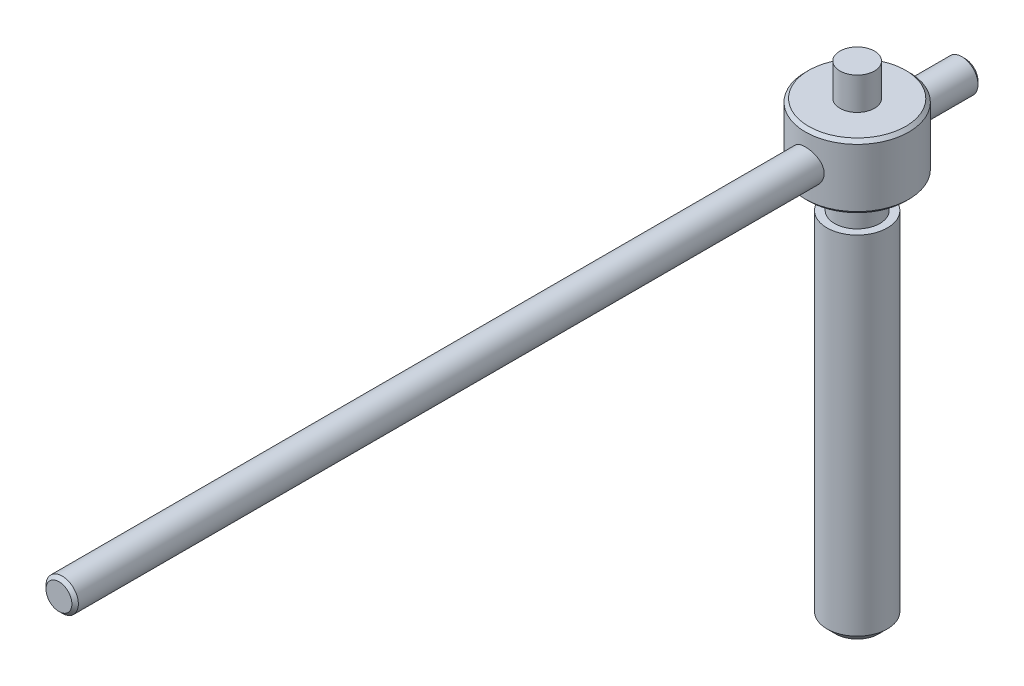
ISO-10303-21;
HEADER;
FILE_DESCRIPTION(('STEP AP214'),'2;1');
FILE_NAME('part.step','',(''),(''),'','','');
FILE_SCHEMA(('AUTOMOTIVE_DESIGN { 1 0 10303 214 1 1 1 1 }'));
ENDSEC;
DATA;
#1=APPLICATION_CONTEXT('core data for automotive mechanical design processes');
#2=APPLICATION_PROTOCOL_DEFINITION('international standard','automotive_design',2000,#1);
#3=PRODUCT_CONTEXT('',#1,'mechanical');
#4=PRODUCT('Part','Part','',(#3));
#5=PRODUCT_RELATED_PRODUCT_CATEGORY('part','',(#4));
#6=PRODUCT_DEFINITION_FORMATION('','',#4);
#7=PRODUCT_DEFINITION_CONTEXT('part definition',#1,'design');
#8=PRODUCT_DEFINITION('design','',#6,#7);
#9=PRODUCT_DEFINITION_SHAPE('','',#8);
#10=(LENGTH_UNIT() NAMED_UNIT(*) SI_UNIT(.MILLI.,.METRE.));
#11=(NAMED_UNIT(*) PLANE_ANGLE_UNIT() SI_UNIT($,.RADIAN.));
#12=(NAMED_UNIT(*) SI_UNIT($,.STERADIAN.) SOLID_ANGLE_UNIT());
#13=UNCERTAINTY_MEASURE_WITH_UNIT(LENGTH_MEASURE(1.E-05),#10,'distance_accuracy_value','');
#14=(GEOMETRIC_REPRESENTATION_CONTEXT(3) GLOBAL_UNCERTAINTY_ASSIGNED_CONTEXT((#13)) GLOBAL_UNIT_ASSIGNED_CONTEXT((#10,
#11,#12)) REPRESENTATION_CONTEXT('',''));
#15=CARTESIAN_POINT('',(0.,0.,0.));
#16=DIRECTION('',(0.,0.,1.));
#17=DIRECTION('',(1.,0.,0.));
#18=AXIS2_PLACEMENT_3D('',#15,#16,#17);
#19=CARTESIAN_POINT('',(0.,165.,0.));
#20=DIRECTION('',(0.,-1.,0.));
#21=DIRECTION('',(0.,0.,-1.));
#22=AXIS2_PLACEMENT_3D('',#19,#20,#21);
#23=CYLINDRICAL_SURFACE('',#22,14.);
#24=CARTESIAN_POINT('',(0.,3.99999999999998,0.));
#25=DIRECTION('',(0.,1.,0.));
#26=DIRECTION('',(0.,0.,1.));
#27=AXIS2_PLACEMENT_3D('',#24,#25,#26);
#28=CIRCLE('',#27,14.);
#29=CARTESIAN_POINT('',(0.,3.99999999999998,14.));
#30=VERTEX_POINT('',#29);
#31=EDGE_CURVE('E329',#30,#30,#28,.T.);
#32=ORIENTED_EDGE('',*,*,#31,.T.);
#33=EDGE_LOOP('',(#32));
#34=FACE_BOUND('',#33,.T.);
#35=CARTESIAN_POINT('',(0.,165.,0.));
#36=DIRECTION('',(0.,1.,0.));
#37=DIRECTION('',(0.,0.,1.));
#38=AXIS2_PLACEMENT_3D('',#35,#36,#37);
#39=CIRCLE('',#38,14.);
#40=CARTESIAN_POINT('',(0.,165.,14.));
#41=VERTEX_POINT('',#40);
#42=EDGE_CURVE('E335',#41,#41,#39,.T.);
#43=ORIENTED_EDGE('',*,*,#42,.F.);
#44=EDGE_LOOP('',(#43));
#45=FACE_BOUND('',#44,.T.);
#46=ADVANCED_FACE('F41',(#34,#45),#23,.T.);
#47=CARTESIAN_POINT('',(0.,165.,0.));
#48=DIRECTION('',(0.,1.,0.));
#49=DIRECTION('',(0.,0.,1.));
#50=AXIS2_PLACEMENT_3D('',#47,#48,#49);
#51=PLANE('',#50);
#52=CARTESIAN_POINT('',(0.,165.,0.));
#53=DIRECTION('',(0.,1.,0.));
#54=DIRECTION('',(0.,0.,1.));
#55=AXIS2_PLACEMENT_3D('',#52,#53,#54);
#56=CIRCLE('',#55,10.5);
#57=CARTESIAN_POINT('',(0.,165.,10.5));
#58=VERTEX_POINT('',#57);
#59=EDGE_CURVE('E332',#58,#58,#56,.T.);
#60=ORIENTED_EDGE('',*,*,#59,.F.);
#61=EDGE_LOOP('',(#60));
#62=FACE_BOUND('',#61,.T.);
#63=ORIENTED_EDGE('',*,*,#42,.T.);
#64=EDGE_LOOP('',(#63));
#65=FACE_BOUND('',#64,.T.);
#66=ADVANCED_FACE('F122',(#62,#65),#51,.T.);
#67=CARTESIAN_POINT('',(0.,0.,0.));
#68=DIRECTION('',(0.,1.,0.));
#69=DIRECTION('',(0.,0.,1.));
#70=AXIS2_PLACEMENT_3D('',#67,#68,#69);
#71=PLANE('',#70);
#72=CARTESIAN_POINT('',(0.,0.,0.));
#73=DIRECTION('',(0.,1.,0.));
#74=DIRECTION('',(0.,0.,1.));
#75=AXIS2_PLACEMENT_3D('',#72,#73,#74);
#76=CIRCLE('',#75,9.99999999999999);
#77=CARTESIAN_POINT('',(0.,0.,9.99999999999999));
#78=VERTEX_POINT('',#77);
#79=EDGE_CURVE('E328',#78,#78,#76,.F.);
#80=ORIENTED_EDGE('',*,*,#79,.T.);
#81=EDGE_LOOP('',(#80));
#82=FACE_BOUND('',#81,.T.);
#83=ADVANCED_FACE('F128',(#82),#71,.F.);
#84=CARTESIAN_POINT('',(0.,180.,0.));
#85=DIRECTION('',(0.,-1.,0.));
#86=DIRECTION('',(0.,0.,-1.));
#87=AXIS2_PLACEMENT_3D('',#84,#85,#86);
#88=CYLINDRICAL_SURFACE('',#87,10.5);
#89=CARTESIAN_POINT('',(0.,180.,0.));
#90=DIRECTION('',(0.,1.,0.));
#91=DIRECTION('',(0.,0.,1.));
#92=AXIS2_PLACEMENT_3D('',#89,#90,#91);
#93=CIRCLE('',#92,10.5);
#94=CARTESIAN_POINT('',(0.,180.,10.5));
#95=VERTEX_POINT('',#94);
#96=EDGE_CURVE('E338',#95,#95,#93,.T.);
#97=ORIENTED_EDGE('',*,*,#96,.F.);
#98=EDGE_LOOP('',(#97));
#99=FACE_BOUND('',#98,.T.);
#100=ORIENTED_EDGE('',*,*,#59,.T.);
#101=EDGE_LOOP('',(#100));
#102=FACE_BOUND('',#101,.T.);
#103=ADVANCED_FACE('F142',(#99,#102),#88,.T.);
#104=CARTESIAN_POINT('',(0.,3.99999999999998,0.));
#105=DIRECTION('',(0.,1.,0.));
#106=DIRECTION('',(0.,0.,1.));
#107=AXIS2_PLACEMENT_3D('',#104,#105,#106);
#108=CONICAL_SURFACE('',#107,14.,0.785398163397452);
#109=ORIENTED_EDGE('',*,*,#79,.F.);
#110=EDGE_LOOP('',(#109));
#111=FACE_BOUND('',#110,.T.);
#112=ORIENTED_EDGE('',*,*,#31,.F.);
#113=EDGE_LOOP('',(#112));
#114=FACE_BOUND('',#113,.T.);
#115=ADVANCED_FACE('F136',(#111,#114),#108,.T.);
#116=CARTESIAN_POINT('',(0.,210.,0.));
#117=DIRECTION('',(0.,-1.,0.));
#118=DIRECTION('',(0.,0.,-1.));
#119=AXIS2_PLACEMENT_3D('',#116,#117,#118);
#120=CYLINDRICAL_SURFACE('',#119,24.);
#121=CARTESIAN_POINT('',(0.,181.5,0.));
#122=DIRECTION('',(0.,1.,0.));
#123=DIRECTION('',(0.,0.,1.));
#124=AXIS2_PLACEMENT_3D('',#121,#122,#123);
#125=CIRCLE('',#124,24.);
#126=CARTESIAN_POINT('',(0.,181.5,24.));
#127=VERTEX_POINT('',#126);
#128=EDGE_CURVE('E68',#127,#127,#125,.T.);
#129=ORIENTED_EDGE('',*,*,#128,.T.);
#130=EDGE_LOOP('',(#129));
#131=FACE_BOUND('',#130,.T.);
#132=CARTESIAN_POINT('',(0.,208.5,0.));
#133=DIRECTION('',(0.,1.,0.));
#134=DIRECTION('',(0.,0.,1.));
#135=AXIS2_PLACEMENT_3D('',#132,#133,#134);
#136=CIRCLE('',#135,24.);
#137=CARTESIAN_POINT('',(0.,208.5,24.));
#138=VERTEX_POINT('',#137);
#139=EDGE_CURVE('E71',#138,#138,#136,.F.);
#140=ORIENTED_EDGE('',*,*,#139,.T.);
#141=EDGE_LOOP('',(#140));
#142=FACE_BOUND('',#141,.T.);
#143=CARTESIAN_POINT('',(0.,202.5,-24.));
#144=CARTESIAN_POINT('',(-0.205322725134183,202.499999751171,-23.9999998377504));
#145=CARTESIAN_POINT('',(-0.410649569542959,202.491561595386,-23.9973589602172));
#146=CARTESIAN_POINT('',(-0.819788345223739,202.457887308774,-23.9868678496232));
#147=CARTESIAN_POINT('',(-1.02360023659106,202.432650737043,-23.9790174798298));
#148=CARTESIAN_POINT('',(-1.42822261784368,202.365611481602,-23.9583225038608));
#149=CARTESIAN_POINT('',(-1.62903309471248,202.32380872607,-23.9454778760327));
#150=CARTESIAN_POINT('',(-2.02629699725516,202.223993923456,-23.915138103417));
#151=CARTESIAN_POINT('',(-2.22274878087906,202.165975875863,-23.8976412371731));
#152=CARTESIAN_POINT('',(-2.60950749706709,202.034351566784,-23.8585028646378));
#153=CARTESIAN_POINT('',(-2.79982570417056,201.960776037888,-23.8368695375509));
#154=CARTESIAN_POINT('',(-3.17350213971867,201.798560955903,-23.7900068509816));
#155=CARTESIAN_POINT('',(-3.35685771837273,201.709915736609,-23.7647761394598));
#156=CARTESIAN_POINT('',(-3.89458593950664,201.422394777373,-23.684659386319));
#157=CARTESIAN_POINT('',(-4.23696718249441,201.201814869027,-23.6253118391135));
#158=CARTESIAN_POINT('',(-4.88988906798732,200.70199224391,-23.49899818284));
#159=CARTESIAN_POINT('',(-5.19927835160978,200.421287729742,-23.431866009511));
#160=CARTESIAN_POINT('',(-5.62522317764967,199.964910807028,-23.3319148528872));
#161=CARTESIAN_POINT('',(-5.76091944636601,199.806791127462,-23.298702268967));
#162=CARTESIAN_POINT('',(-6.01877901219907,199.479688521212,-23.2334232385609));
#163=CARTESIAN_POINT('',(-6.14094731184569,199.310709646946,-23.2013563713898));
#164=CARTESIAN_POINT('',(-6.37383290789079,198.958528788869,-23.138478391768));
#165=CARTESIAN_POINT('',(-6.48418455843552,198.775075853637,-23.1077192063458));
#166=CARTESIAN_POINT('',(-6.688944845992,198.399090418885,-23.0492809312027));
#167=CARTESIAN_POINT('',(-6.78335934843381,198.206561293241,-23.0216007095998));
#168=CARTESIAN_POINT('',(-6.95551662350109,197.813678488346,-22.9701734139065));
#169=CARTESIAN_POINT('',(-7.03325957764037,197.613324894313,-22.9464262969945));
#170=CARTESIAN_POINT('',(-7.17138329046661,197.20623120454,-22.9036350005793));
#171=CARTESIAN_POINT('',(-7.23176472600763,196.999491358121,-22.8845906377393));
#172=CARTESIAN_POINT('',(-7.33304485595034,196.587480033156,-22.8523345362484));
#173=CARTESIAN_POINT('',(-7.37447517055589,196.382351592993,-22.8389645207808));
#174=CARTESIAN_POINT('',(-7.44007143333098,195.969075403876,-22.8176802195024));
#175=CARTESIAN_POINT('',(-7.46423805677483,195.760927773343,-22.8097657202981));
#176=CARTESIAN_POINT('',(-7.49506665014332,195.343247342939,-22.7996543887654));
#177=CARTESIAN_POINT('',(-7.5017324719861,195.133714858054,-22.7974562982592));
#178=CARTESIAN_POINT('',(-7.49750308016062,194.714849177447,-22.798847640284));
#179=CARTESIAN_POINT('',(-7.4866082861608,194.505515977082,-22.8024369345065));
#180=CARTESIAN_POINT('',(-7.44815028871798,194.09696651092,-22.8150266906269));
#181=CARTESIAN_POINT('',(-7.42126713739477,193.897678956435,-22.8238063001078));
#182=CARTESIAN_POINT('',(-7.35164412083876,193.502110867368,-22.8463271895449));
#183=CARTESIAN_POINT('',(-7.30889898419851,193.305831355053,-22.8600701189185));
#184=CARTESIAN_POINT('',(-7.20793845822806,192.91773770129,-22.8921039351418));
#185=CARTESIAN_POINT('',(-7.14972749669862,192.725922298854,-22.9103935202067));
#186=CARTESIAN_POINT('',(-7.01828248191267,192.347872949696,-22.9510008463907));
#187=CARTESIAN_POINT('',(-6.94504274296934,192.161641146011,-22.9733201116332));
#188=CARTESIAN_POINT('',(-6.78296906367783,191.793385741548,-23.0216980223206));
#189=CARTESIAN_POINT('',(-6.69392810993063,191.611459690793,-23.0478053455082));
#190=CARTESIAN_POINT('',(-6.50160323429421,191.255662029723,-23.1027954365562));
#191=CARTESIAN_POINT('',(-6.39831443500596,191.081793204947,-23.1316791538159));
#192=CARTESIAN_POINT('',(-6.17821458182801,190.743188881368,-23.1914351403816));
#193=CARTESIAN_POINT('',(-6.06140291604376,190.578453796355,-23.2223074996433));
#194=CARTESIAN_POINT('',(-5.81500353033671,190.259070014287,-23.2852292005913));
#195=CARTESIAN_POINT('',(-5.6854154157877,190.104421629026,-23.3172785786129));
#196=CARTESIAN_POINT('',(-5.40803838855426,189.799273726757,-23.3832066732621));
#197=CARTESIAN_POINT('',(-5.25968805523365,189.649287623095,-23.4171020059705));
#198=CARTESIAN_POINT('',(-4.95086825425923,189.362330337025,-23.4843322989423));
#199=CARTESIAN_POINT('',(-4.79040268091213,189.225355004151,-23.5176674350978));
#200=CARTESIAN_POINT('',(-4.45824050436648,188.965216591424,-23.5828909399427));
#201=CARTESIAN_POINT('',(-4.28653884197012,188.842059802249,-23.6147786458101));
#202=CARTESIAN_POINT('',(-3.93312831197264,188.610547166287,-23.6762043413147));
#203=CARTESIAN_POINT('',(-3.75142342237099,188.502185494715,-23.7057432537393));
#204=CARTESIAN_POINT('',(-3.37758895799203,188.300194057681,-23.7619003023785));
#205=CARTESIAN_POINT('',(-3.18538580157275,188.206693084113,-23.7884923568036));
#206=CARTESIAN_POINT('',(-2.7933405676538,188.036314838758,-23.837706641365));
#207=CARTESIAN_POINT('',(-2.59350145142372,187.959431198144,-23.8603303917808));
#208=CARTESIAN_POINT('',(-2.18756250688948,187.822923869234,-23.900965941962));
#209=CARTESIAN_POINT('',(-1.98146298862409,187.763299327737,-23.9189779697021));
#210=CARTESIAN_POINT('',(-1.56454921598557,187.661866284005,-23.9498615550411));
#211=CARTESIAN_POINT('',(-1.353735150212,187.620057070427,-23.9627333178827));
#212=CARTESIAN_POINT('',(-0.937249723618294,187.555926706281,-23.982563170254));
#213=CARTESIAN_POINT('',(-0.731694449214662,187.532914895044,-23.9897305656508));
#214=CARTESIAN_POINT('',(-0.319271296139881,187.503948034065,-23.9987625447026));
#215=CARTESIAN_POINT('',(-0.112403452699271,187.497992528441,-24.0006272700876));
#216=CARTESIAN_POINT('',(0.301067522756543,187.503193989518,-23.9990019562826));
#217=CARTESIAN_POINT('',(0.507670685894437,187.514348714948,-23.9955126184216));
#218=CARTESIAN_POINT('',(0.919093871119439,187.553660697763,-23.9832779342683));
#219=CARTESIAN_POINT('',(1.12391390765372,187.581817817261,-23.9745326306009));
#220=CARTESIAN_POINT('',(1.52516099292489,187.653954170231,-23.9523119121127));
#221=CARTESIAN_POINT('',(1.72166969320957,187.697518769019,-23.9389606608393));
#222=CARTESIAN_POINT('',(2.11028998353638,187.800202615519,-23.9078374038334));
#223=CARTESIAN_POINT('',(2.30240007974011,187.859327064875,-23.8900639198611));
#224=CARTESIAN_POINT('',(2.68084378731564,187.992624286464,-23.8505611345128));
#225=CARTESIAN_POINT('',(2.86717893637272,188.0667930125,-23.8288328969387));
#226=CARTESIAN_POINT('',(3.23302579667981,188.229648974261,-23.781958970286));
#227=CARTESIAN_POINT('',(3.41253490163624,188.318341688236,-23.7568119923151));
#228=CARTESIAN_POINT('',(3.76779434531039,188.511886296499,-23.7030962478877));
#229=CARTESIAN_POINT('',(3.94335090154579,188.617075092219,-23.6744598118865));
#230=CARTESIAN_POINT('',(4.28508888954255,188.841283124861,-23.6149975609094));
#231=CARTESIAN_POINT('',(4.45126705394941,188.960307138209,-23.5841709912553));
#232=CARTESIAN_POINT('',(4.77321005884027,189.211378442719,-23.521126184381));
#233=CARTESIAN_POINT('',(4.92897418901323,189.343426620704,-23.4889078524789));
#234=CARTESIAN_POINT('',(5.22916190190809,189.619713719119,-23.4239077863322));
#235=CARTESIAN_POINT('',(5.37358523830359,189.763952904202,-23.3911260398689));
#236=CARTESIAN_POINT('',(5.65574755611655,190.069735867166,-23.3245442482174));
#237=CARTESIAN_POINT('',(5.7929906014498,190.231740247261,-23.2907557009971));
#238=CARTESIAN_POINT('',(6.05332022130686,190.566905510281,-23.2244560032561));
#239=CARTESIAN_POINT('',(6.17641153784875,190.740062625581,-23.1919444272611));
#240=CARTESIAN_POINT('',(6.40767164258911,191.096552628294,-23.1291182822734));
#241=CARTESIAN_POINT('',(6.51583455782912,191.279889480952,-23.0988045801562));
#242=CARTESIAN_POINT('',(6.71632072791784,191.655404827851,-23.0413088407619));
#243=CARTESIAN_POINT('',(6.80865052748186,191.847579627011,-23.0141255110598));
#244=CARTESIAN_POINT('',(6.97647892399103,192.238859130563,-22.96380621771));
#245=CARTESIAN_POINT('',(7.05203484907426,192.437937456056,-22.9406565285295));
#246=CARTESIAN_POINT('',(7.18603319154452,192.842166519652,-22.8990360803296));
#247=CARTESIAN_POINT('',(7.24448241353361,193.047314807429,-22.8805634612887));
#248=CARTESIAN_POINT('',(7.34375231610201,193.462211374598,-22.848895397));
#249=CARTESIAN_POINT('',(7.384575095796,193.67195910312,-22.8356993233876));
#250=CARTESIAN_POINT('',(7.44819469414369,194.094447299313,-22.8150283856312));
#251=CARTESIAN_POINT('',(7.47099227726117,194.307187639676,-22.8075532788565));
#252=CARTESIAN_POINT('',(7.49771064294923,194.724294859985,-22.7987832741142));
#253=CARTESIAN_POINT('',(7.50243921576498,194.928604849242,-22.7972239310468));
#254=CARTESIAN_POINT('',(7.49521090674663,195.336896191842,-22.7996015156985));
#255=CARTESIAN_POINT('',(7.48325431134384,195.540877550766,-22.8035383490657));
#256=CARTESIAN_POINT('',(7.44277084953878,195.94699774529,-22.8167835798402));
#257=CARTESIAN_POINT('',(7.41424495273264,196.149136688,-22.8260916629346));
#258=CARTESIAN_POINT('',(7.34088853988209,196.550129066818,-22.8497885761783));
#259=CARTESIAN_POINT('',(7.29605795470685,196.748982488991,-22.8641774278698));
#260=CARTESIAN_POINT('',(7.19127743080789,197.139091904865,-22.8973469597821));
#261=CARTESIAN_POINT('',(7.13156223124892,197.330416902638,-22.9160591514322));
#262=CARTESIAN_POINT('',(6.99716063418775,197.707359412064,-22.9574537966096));
#263=CARTESIAN_POINT('',(6.92246923608568,197.892974993385,-22.9801375759408));
#264=CARTESIAN_POINT('',(6.75871120993063,198.257252775182,-23.0288322203934));
#265=CARTESIAN_POINT('',(6.66964720697428,198.43591623805,-23.0548424777677));
#266=CARTESIAN_POINT('',(6.47773101504851,198.785333369464,-23.1094992362476));
#267=CARTESIAN_POINT('',(6.37487388753478,198.956084175328,-23.1381466804248));
#268=CARTESIAN_POINT('',(6.15180562104566,199.295119403823,-23.1984729592827));
#269=CARTESIAN_POINT('',(6.03107452319997,199.463048604738,-23.2302264110723));
#270=CARTESIAN_POINT('',(5.77628434080353,199.788236530681,-23.2948880612276));
#271=CARTESIAN_POINT('',(5.64222486473063,199.945494942025,-23.3277962934968));
#272=CARTESIAN_POINT('',(5.36156593588138,200.248453656183,-23.3938966126454));
#273=CARTESIAN_POINT('',(5.21496129136701,200.394149125201,-23.4270888118785));
#274=CARTESIAN_POINT('',(4.91020758027418,200.672962301218,-23.4928531672747));
#275=CARTESIAN_POINT('',(4.75206237192804,200.806084177971,-23.5254255261125));
#276=CARTESIAN_POINT('',(4.41972055532893,201.063138395092,-23.5901603004584));
#277=CARTESIAN_POINT('',(4.24516594895487,201.186620833839,-23.622273477587));
#278=CARTESIAN_POINT('',(3.88590361550681,201.418366581645,-23.6840232253637));
#279=CARTESIAN_POINT('',(3.7011995883563,201.52663538623,-23.7136606887216));
#280=CARTESIAN_POINT('',(3.32283847153091,201.727152349284,-23.7696299451859));
#281=CARTESIAN_POINT('',(3.12918255783227,201.819402604521,-23.7959621708101));
#282=CARTESIAN_POINT('',(2.73425079317586,201.987123002583,-23.8445683608793));
#283=CARTESIAN_POINT('',(2.53297555799437,202.062594498056,-23.8668426524352));
#284=CARTESIAN_POINT('',(2.14159886031168,202.190429209189,-23.904996906578));
#285=CARTESIAN_POINT('',(1.95199597767635,202.244208721182,-23.9212587889421));
#286=CARTESIAN_POINT('',(1.5687634794647,202.336746420601,-23.9494447033193));
#287=CARTESIAN_POINT('',(1.37513246393651,202.375499290514,-23.9613671996524));
#288=CARTESIAN_POINT('',(0.985222138126735,202.437627528428,-23.9805635724611));
#289=CARTESIAN_POINT('',(0.788943269401387,202.461005428786,-23.9878382144631));
#290=CARTESIAN_POINT('',(0.395110522251881,202.492188765891,-23.9975555697243));
#291=CARTESIAN_POINT('',(0.197557167913419,202.500000239418,-24.0000001561132));
#292=CARTESIAN_POINT('',(0.,202.5,-24.));
#293=B_SPLINE_CURVE_WITH_KNOTS('',3,(#143,#144,#145,#146,#147,#148,#149,#150,#151,#152,#153,
#154,#155,#156,#157,#158,#159,#160,#161,#162,#163,#164,#165,#166,#167,#168,#169,#170,#171,#172,
#173,#174,#175,#176,#177,#178,#179,#180,#181,#182,#183,#184,#185,#186,#187,#188,#189,#190,#191,
#192,#193,#194,#195,#196,#197,#198,#199,#200,#201,#202,#203,#204,#205,#206,#207,#208,#209,#210,
#211,#212,#213,#214,#215,#216,#217,#218,#219,#220,#221,#222,#223,#224,#225,#226,#227,#228,#229,
#230,#231,#232,#233,#234,#235,#236,#237,#238,#239,#240,#241,#242,#243,#244,#245,#246,#247,#248,
#249,#250,#251,#252,#253,#254,#255,#256,#257,#258,#259,#260,#261,#262,#263,#264,#265,#266,#267,
#268,#269,#270,#271,#272,#273,#274,#275,#276,#277,#278,#279,#280,#281,#282,#283,#284,#285,#286,
#287,#288,#289,#290,#291,#292),.UNSPECIFIED.,.T.,.F.,(4,2,2,2,2,2,2,2,2,2,2,2,2,2,2,2,2,2,2,2,2,
2,2,2,2,2,2,2,2,2,2,2,2,2,2,2,2,2,2,2,2,2,2,2,2,2,2,2,2,2,2,2,2,2,2,2,2,2,2,2,2,2,2,2,2,2,2,2,2,
2,2,2,2,2,4),(0.,0.61578575949743,1.23158768205225,1.84739227443666,2.46342504937368,
3.07825208241681,3.69331080388809,4.92233545802383,6.18556526038298,6.81795282859594,
7.45010575866716,8.0981709460351,8.74599710016006,9.39381620062945,10.041610041877,
10.6699095444067,11.298184469472,11.9263210999266,12.5544427192214,13.1575868900243,
13.7609316832687,14.3641039272186,14.9675047853901,15.5794892883362,16.1916838114246,
16.8039060464636,17.4161471971401,18.056395499235,18.6964388698399,19.3367724381893,
19.9768531780835,20.6222098685737,21.2673187767063,21.9123957885282,22.5574470408512,
23.1775709279552,23.797678240198,24.4177043314816,25.037725394533,25.6421925498485,
26.2468620352557,26.8513691084205,27.4561047208284,28.0753625304383,28.6948347691717,
29.3143492172942,29.9338771177891,30.5781005942124,31.2221075685778,31.8663671828882,
32.5103598432337,33.1521164330445,33.7936174007307,34.4350419516482,35.0764392977502,
35.6888021793648,36.3011545487839,36.9134710884071,37.525790224243,38.1290041158202,
38.7324197588389,39.3357253149748,39.9392474606268,40.5662809890488,41.1933329420754,
41.8206456633235,42.4477496142866,43.0956064666582,43.7432286927839,44.39076608361,
45.0382512531918,45.6308652962827,46.2236888581205,46.8164147535804,47.4089107406087),.UNSPECIFIED.);
#294=CARTESIAN_POINT('',(0.,202.5,-24.));
#295=VERTEX_POINT('',#294);
#296=EDGE_CURVE('E75',#295,#295,#293,.T.);
#297=ORIENTED_EDGE('',*,*,#296,.T.);
#298=EDGE_LOOP('',(#297));
#299=FACE_BOUND('',#298,.T.);
#300=CARTESIAN_POINT('',(7.5,195.,22.798026230356));
#301=CARTESIAN_POINT('',(7.49999974700773,194.794953473911,22.7980264222482));
#302=CARTESIAN_POINT('',(7.49158409238975,194.589902804104,22.8008000560015));
#303=CARTESIAN_POINT('',(7.45800176499308,194.181324355647,22.811806564275));
#304=CARTESIAN_POINT('',(7.43283463820416,193.977796618424,22.8200395867594));
#305=CARTESIAN_POINT('',(7.36598489208762,193.573746620706,22.8417052387465));
#306=CARTESIAN_POINT('',(7.32430158745593,193.373224485279,22.8551380840043));
#307=CARTESIAN_POINT('',(7.22478128927094,192.976544363525,22.8867922146891));
#308=CARTESIAN_POINT('',(7.16693826028762,192.780388037376,22.9050152890489));
#309=CARTESIAN_POINT('',(7.03573656859373,192.394259337092,22.945655673757));
#310=CARTESIAN_POINT('',(6.96241208752277,192.204274386225,22.9680637316623));
#311=CARTESIAN_POINT('',(6.80075942305939,191.831238208446,23.0164457249172));
#312=CARTESIAN_POINT('',(6.71242558420898,191.64818962704,23.0424210036694));
#313=CARTESIAN_POINT('',(6.42591332355301,191.11130514933,23.1246020655355));
#314=CARTESIAN_POINT('',(6.20610879065265,190.769393101122,23.1851005811227));
#315=CARTESIAN_POINT('',(5.70710399963079,190.116029536159,23.3130219776492));
#316=CARTESIAN_POINT('',(5.4262668934208,189.80585857615,23.3806018462209));
#317=CARTESIAN_POINT('',(4.96943962580651,189.378763633746,23.4803981200992));
#318=CARTESIAN_POINT('',(4.81113113115132,189.242689759308,23.5134203474061));
#319=CARTESIAN_POINT('',(4.48357099100345,188.984098592999,23.5780705240379));
#320=CARTESIAN_POINT('',(4.31432347663338,188.861576230245,23.6096989922143));
#321=CARTESIAN_POINT('',(3.96189595864876,188.62825927248,23.6714199529493));
#322=CARTESIAN_POINT('',(3.7784846002785,188.517800474826,23.7014601722145));
#323=CARTESIAN_POINT('',(3.40256768378339,188.312822618684,23.7583384799785));
#324=CARTESIAN_POINT('',(3.21006550637826,188.218297693496,23.7851777459686));
#325=CARTESIAN_POINT('',(2.81723436397066,188.04592215844,23.8348984438295));
#326=CARTESIAN_POINT('',(2.61690530154658,187.968071756198,23.8577798264172));
#327=CARTESIAN_POINT('',(2.2098763363084,187.829739010417,23.8989179134953));
#328=CARTESIAN_POINT('',(2.00317667118578,187.769256019754,23.9171747902953));
#329=CARTESIAN_POINT('',(1.59142684741146,187.667816060506,23.9480408393514));
#330=CARTESIAN_POINT('',(1.38652264351255,187.62631410466,23.9608069171928));
#331=CARTESIAN_POINT('',(0.973714193630963,187.560540312013,23.9811296527184));
#332=CARTESIAN_POINT('',(0.765810052365474,187.536267875269,23.9886864917917));
#333=CARTESIAN_POINT('',(0.348613500135681,187.505187404498,23.9983748909556));
#334=CARTESIAN_POINT('',(0.139321357676894,187.498376086085,24.0005074713331));
#335=CARTESIAN_POINT('',(-0.279081496408187,187.502275024589,23.9992890605664));
#336=CARTESIAN_POINT('',(-0.488192211591743,187.512984929825,23.9959381794845));
#337=CARTESIAN_POINT('',(-0.897386858062001,187.551144718768,23.9840599696606));
#338=CARTESIAN_POINT('',(-1.09753193806446,187.577999898937,23.9757165863245));
#339=CARTESIAN_POINT('',(-1.49482266971481,187.647708321365,23.9542291427508));
#340=CARTESIAN_POINT('',(-1.69196729778038,187.690566901155,23.9410834808658));
#341=CARTESIAN_POINT('',(-2.0817747471789,187.791896428239,23.9103414822127));
#342=CARTESIAN_POINT('',(-2.27443899007203,187.850362348003,23.8927465787567));
#343=CARTESIAN_POINT('',(-2.65415400239954,187.982458288355,23.8535514046846));
#344=CARTESIAN_POINT('',(-2.84120262757653,188.056094019061,23.8319496261335));
#345=CARTESIAN_POINT('',(-3.21060832462452,188.218907260486,23.7850178233697));
#346=CARTESIAN_POINT('',(-3.39288346812399,188.308258703421,23.7596466289881));
#347=CARTESIAN_POINT('',(-3.74933035165497,188.501260571493,23.7060123442231));
#348=CARTESIAN_POINT('',(-3.92349928623937,188.604915898516,23.67774826332));
#349=CARTESIAN_POINT('',(-4.26263465978632,188.825787740165,23.619050899331));
#350=CARTESIAN_POINT('',(-4.42760075853918,188.943004755647,23.5886175361459));
#351=CARTESIAN_POINT('',(-4.74736710964657,189.190236435902,23.5263478636096));
#352=CARTESIAN_POINT('',(-4.90216703842023,189.320251507698,23.4945115096563));
#353=CARTESIAN_POINT('',(-5.20696226006289,189.59798075494,23.428889325145));
#354=CARTESIAN_POINT('',(-5.3564847251942,189.746208169505,23.3950776934464));
#355=CARTESIAN_POINT('',(-5.64252659687117,190.054686480488,23.3277406070092));
#356=CARTESIAN_POINT('',(-5.77905013185327,190.21493353039,23.2942150645095));
#357=CARTESIAN_POINT('',(-6.03832079381708,190.54657392947,23.2283573538321));
#358=CARTESIAN_POINT('',(-6.16106111740694,190.717972717794,23.1960257802357));
#359=CARTESIAN_POINT('',(-6.39179285887947,191.070702355177,23.1335096917575));
#360=CARTESIAN_POINT('',(-6.49979002148856,191.252029296885,23.103324342801));
#361=CARTESIAN_POINT('',(-6.70146025809924,191.625681954266,23.0456408967694));
#362=CARTESIAN_POINT('',(-6.79495201481053,191.818111108594,23.0181781595255));
#363=CARTESIAN_POINT('',(-6.96528140892233,192.210626367214,22.9672105647925));
#364=CARTESIAN_POINT('',(-7.0421254589343,192.410709488169,22.9437041841164));
#365=CARTESIAN_POINT('',(-7.17851865799902,192.817154627315,22.9013967635139));
#366=CARTESIAN_POINT('',(-7.238069465127,193.023516041444,22.8825952725067));
#367=CARTESIAN_POINT('',(-7.33931767509125,193.440980576476,22.8503226769008));
#368=CARTESIAN_POINT('',(-7.38101586716288,193.65208348733,22.8368513366666));
#369=CARTESIAN_POINT('',(-7.44483362974042,194.068824332417,22.8161243467247));
#370=CARTESIAN_POINT('',(-7.46767263323138,194.274340979293,22.8086406729225));
#371=CARTESIAN_POINT('',(-7.49630175334413,194.686683295234,22.7992475765619));
#372=CARTESIAN_POINT('',(-7.50209237560239,194.893508925293,22.7973379886823));
#373=CARTESIAN_POINT('',(-7.49656908204168,195.306876901055,22.7991547983648));
#374=CARTESIAN_POINT('',(-7.48525752295286,195.513419281864,22.802880419379));
#375=CARTESIAN_POINT('',(-7.44564462140372,195.924690990566,22.8158455729099));
#376=CARTESIAN_POINT('',(-7.41734344315546,196.129420335963,22.8250850521328));
#377=CARTESIAN_POINT('',(-7.34509239009019,196.529625396581,22.8484356129412));
#378=CARTESIAN_POINT('',(-7.30162279086193,196.725196881454,22.8623968150771));
#379=CARTESIAN_POINT('',(-7.19928354353672,197.111952514343,22.8948290130384));
#380=CARTESIAN_POINT('',(-7.14040876505728,197.303135177636,22.9133015111225));
#381=CARTESIAN_POINT('',(-7.00776064113061,197.679765830322,22.9542175242077));
#382=CARTESIAN_POINT('',(-6.93399077553614,197.865215147518,22.9766601115485));
#383=CARTESIAN_POINT('',(-6.77207489750803,198.229353235371,23.0249025115563));
#384=CARTESIAN_POINT('',(-6.68392344025176,198.408039413839,23.050703594988));
#385=CARTESIAN_POINT('',(-6.4911933846454,198.762478583336,23.1057293721498));
#386=CARTESIAN_POINT('',(-6.3862203147421,198.93800524828,23.1350303216444));
#387=CARTESIAN_POINT('',(-6.16244208488249,199.279723877635,23.1956406424339));
#388=CARTESIAN_POINT('',(-6.04363214462857,199.445912586442,23.2269507061409));
#389=CARTESIAN_POINT('',(-5.79297276792312,199.76792397301,23.2907317829355));
#390=CARTESIAN_POINT('',(-5.66112254515768,199.923746024725,23.3232028659557));
#391=CARTESIAN_POINT('',(-5.38520106750758,200.22409781741,23.3884523674779));
#392=CARTESIAN_POINT('',(-5.24112957763704,200.368627341148,23.4212307918785));
#393=CARTESIAN_POINT('',(-4.93537430002099,200.651301917205,23.4876042931041));
#394=CARTESIAN_POINT('',(-4.77320665347608,200.78892957931,23.5211764432266));
#395=CARTESIAN_POINT('',(-4.43763354342204,201.050007149637,23.5867891557625));
#396=CARTESIAN_POINT('',(-4.26423189649997,201.173461833819,23.6188302319744));
#397=CARTESIAN_POINT('',(-3.90718977346166,201.405404088724,23.6805129760515));
#398=CARTESIAN_POINT('',(-3.72354558347082,201.513886180297,23.7101537639111));
#399=CARTESIAN_POINT('',(-3.3473696731749,201.714951918452,23.7661788392512));
#400=CARTESIAN_POINT('',(-3.15484168262613,201.807542161348,23.7925644765792));
#401=CARTESIAN_POINT('',(-2.76352284397654,201.975525841389,23.8411731817023));
#402=CARTESIAN_POINT('',(-2.56478500122681,202.051034642243,23.8634239807907));
#403=CARTESIAN_POINT('',(-2.16127384670085,202.18498895197,23.9033465587577));
#404=CARTESIAN_POINT('',(-1.95650294714012,202.243441181364,23.921020140813));
#405=CARTESIAN_POINT('',(-1.54238491380027,202.34277778516,23.9512869247162));
#406=CARTESIAN_POINT('',(-1.33303806661622,202.383663256486,23.9638804437767));
#407=CARTESIAN_POINT('',(-0.911372775736269,202.447473583657,23.9836181350998));
#408=CARTESIAN_POINT('',(-0.699054441854916,202.470399101458,23.9907625082029));
#409=CARTESIAN_POINT('',(-0.282003923118207,202.497486627596,23.9992114711577));
#410=CARTESIAN_POINT('',(-0.0773242573085355,202.5023906482,24.0007469820781));
#411=CARTESIAN_POINT('',(0.331722087872122,202.495451921446,23.9985788646869));
#412=CARTESIAN_POINT('',(0.5360887722104,202.483609442688,23.9948753204048));
#413=CARTESIAN_POINT('',(0.942997165197122,202.44328925698,23.9823307757689));
#414=CARTESIAN_POINT('',(1.14553900795056,202.414812782733,23.9734901561107));
#415=CARTESIAN_POINT('',(1.54735710042257,202.341484535684,23.9509118803214));
#416=CARTESIAN_POINT('',(1.74663333861127,202.296632705079,23.9371742069043));
#417=CARTESIAN_POINT('',(2.13801590602426,202.19162139663,23.905374914283));
#418=CARTESIAN_POINT('',(2.33018121119597,202.131664024465,23.8873705568879));
#419=CARTESIAN_POINT('',(2.70877279078646,201.996638866229,23.8474065199221));
#420=CARTESIAN_POINT('',(2.89519711782898,201.921566016589,23.8254455151649));
#421=CARTESIAN_POINT('',(3.26102744931492,201.756917052867,23.7781352230774));
#422=CARTESIAN_POINT('',(3.44043493130121,201.667344012739,23.752786654089));
#423=CARTESIAN_POINT('',(3.79125392944047,201.474295010926,23.6993226375981));
#424=CARTESIAN_POINT('',(3.96266255797127,201.370814079944,23.6712062021005));
#425=CARTESIAN_POINT('',(4.30205621280843,201.146952057811,23.6119245784662));
#426=CARTESIAN_POINT('',(4.46973051821338,201.026118504336,23.5806885267417));
#427=CARTESIAN_POINT('',(4.79438406538428,200.771176990063,23.5168292527002));
#428=CARTESIAN_POINT('',(4.9513629865534,200.637068631643,23.4842059888487));
#429=CARTESIAN_POINT('',(5.25374558285255,200.35637300849,23.4184139709667));
#430=CARTESIAN_POINT('',(5.3991441142115,200.209780257609,23.3852449823422));
#431=CARTESIAN_POINT('',(5.67735406800131,199.905119050994,23.3192643076598));
#432=CARTESIAN_POINT('',(5.81016961251022,199.747054383537,23.2864525077294));
#433=CARTESIAN_POINT('',(6.0666672191413,199.414866521116,23.2209744935802));
#434=CARTESIAN_POINT('',(6.18989305949454,199.240382391177,23.1883501353028));
#435=CARTESIAN_POINT('',(6.42113807438516,198.881310397077,23.1253831815098));
#436=CARTESIAN_POINT('',(6.52916272193019,198.696726202737,23.09503976661));
#437=CARTESIAN_POINT('',(6.72921826253982,198.318637912672,23.0375445276741));
#438=CARTESIAN_POINT('',(6.82125139084542,198.125135068359,23.0103922577626));
#439=CARTESIAN_POINT('',(6.98857459208391,197.73052085755,22.9601277123422));
#440=CARTESIAN_POINT('',(7.06386605071025,197.529410122366,22.9370151025082));
#441=CARTESIAN_POINT('',(7.19134651738427,197.138485585613,22.8973491953231));
#442=CARTESIAN_POINT('',(7.24495981962066,196.949174789243,22.8804041799857));
#443=CARTESIAN_POINT('',(7.33721739264177,196.566519701422,22.8509866555925));
#444=CARTESIAN_POINT('',(7.37585640374491,196.37317401781,22.8385157181592));
#445=CARTESIAN_POINT('',(7.4378037218357,195.983831218827,22.8184166545128));
#446=CARTESIAN_POINT('',(7.46111513458571,195.787834648812,22.8107875472324));
#447=CARTESIAN_POINT('',(7.49221037310741,195.394559645123,22.8005932284684));
#448=CARTESIAN_POINT('',(7.50000024341186,195.197281740476,22.7980260457305));
#449=CARTESIAN_POINT('',(7.5,195.,22.798026230356));
#450=B_SPLINE_CURVE_WITH_KNOTS('',3,(#300,#301,#302,#303,#304,#305,#306,#307,#308,#309,#310,
#311,#312,#313,#314,#315,#316,#317,#318,#319,#320,#321,#322,#323,#324,#325,#326,#327,#328,#329,
#330,#331,#332,#333,#334,#335,#336,#337,#338,#339,#340,#341,#342,#343,#344,#345,#346,#347,#348,
#349,#350,#351,#352,#353,#354,#355,#356,#357,#358,#359,#360,#361,#362,#363,#364,#365,#366,#367,
#368,#369,#370,#371,#372,#373,#374,#375,#376,#377,#378,#379,#380,#381,#382,#383,#384,#385,#386,
#387,#388,#389,#390,#391,#392,#393,#394,#395,#396,#397,#398,#399,#400,#401,#402,#403,#404,#405,
#406,#407,#408,#409,#410,#411,#412,#413,#414,#415,#416,#417,#418,#419,#420,#421,#422,#423,#424,
#425,#426,#427,#428,#429,#430,#431,#432,#433,#434,#435,#436,#437,#438,#439,#440,#441,#442,#443,
#444,#445,#446,#447,#448,#449),.UNSPECIFIED.,.T.,.F.,(4,2,2,2,2,2,2,2,2,2,2,2,2,2,2,2,2,2,2,2,2,
2,2,2,2,2,2,2,2,2,2,2,2,2,2,2,2,2,2,2,2,2,2,2,2,2,2,2,2,2,2,2,2,2,2,2,2,2,2,2,2,2,2,2,2,2,2,2,2,
2,2,2,2,2,4),(0.,0.614956230317805,1.22992912829302,1.84492754594837,2.46015596465283,
3.07403996005281,3.6881557791879,4.91532474402608,6.18071874752665,6.81416522018106,
7.44737385384519,8.09519164173764,8.74277038581116,9.39035719289695,10.0379198672636,
10.6654981601938,11.2930545993319,11.9204929882558,12.547918783586,13.1535395083618,
13.7593624033467,14.364990382064,14.9708467450739,15.5838869957599,16.1971378571338,
16.8104113741123,17.4237044016331,18.0626856151049,18.701463207609,19.3405547274785,
19.9793965078483,20.6256726008186,21.2716993071672,21.9176640520423,22.563600236907,
23.1835794067179,23.8035401884352,24.4234155455464,25.0432849113896,25.6450826508635,
26.2470810625165,26.8489389951664,27.4510253202617,28.0701603269575,28.6895098676092,
29.3088967771154,29.9282955986581,30.5735178686511,31.2185220718119,31.8637616889655,
32.5087328319824,33.1492085224631,33.789431514942,34.4296145240137,35.0697739365651,
35.6832600168321,36.2967362574817,36.9101670407622,37.5235999894176,38.1292250195624,
38.7350532679972,39.3407532522099,39.9466702315513,40.573034047068,41.1994166297451,
41.8260759047789,42.4525291766037,43.1000102276418,43.7472575611391,44.3944143516671,
45.0415175576344,45.6333292327187,46.2253485921474,46.8172479563563,47.4089167729303),.UNSPECIFIED.);
#451=CARTESIAN_POINT('',(7.5,195.,22.798026230356));
#452=VERTEX_POINT('',#451);
#453=EDGE_CURVE('E84',#452,#452,#450,.T.);
#454=ORIENTED_EDGE('',*,*,#453,.T.);
#455=EDGE_LOOP('',(#454));
#456=FACE_BOUND('',#455,.T.);
#457=ADVANCED_FACE('F89',(#131,#142,#299,#456),#120,.T.);
#458=CARTESIAN_POINT('',(0.,210.,0.));
#459=DIRECTION('',(0.,1.,0.));
#460=DIRECTION('',(0.,0.,1.));
#461=AXIS2_PLACEMENT_3D('',#458,#459,#460);
#462=PLANE('',#461);
#463=CARTESIAN_POINT('',(0.,210.,0.));
#464=DIRECTION('',(0.,1.,0.));
#465=DIRECTION('',(0.,0.,1.));
#466=AXIS2_PLACEMENT_3D('',#463,#464,#465);
#467=CIRCLE('',#466,22.5);
#468=CARTESIAN_POINT('',(0.,210.,22.5));
#469=VERTEX_POINT('',#468);
#470=EDGE_CURVE('E10',#469,#469,#467,.T.);
#471=ORIENTED_EDGE('',*,*,#470,.T.);
#472=EDGE_LOOP('',(#471));
#473=FACE_BOUND('',#472,.T.);
#474=CARTESIAN_POINT('',(0.,210.,0.));
#475=DIRECTION('',(0.,1.,0.));
#476=DIRECTION('',(0.,0.,1.));
#477=AXIS2_PLACEMENT_3D('',#474,#475,#476);
#478=CIRCLE('',#477,8.);
#479=CARTESIAN_POINT('',(0.,210.,8.));
#480=VERTEX_POINT('',#479);
#481=EDGE_CURVE('E74',#480,#480,#478,.T.);
#482=ORIENTED_EDGE('',*,*,#481,.F.);
#483=EDGE_LOOP('',(#482));
#484=FACE_BOUND('',#483,.T.);
#485=ADVANCED_FACE('F113',(#473,#484),#462,.T.);
#486=CARTESIAN_POINT('',(0.,180.,0.));
#487=DIRECTION('',(0.,1.,0.));
#488=DIRECTION('',(0.,0.,1.));
#489=AXIS2_PLACEMENT_3D('',#486,#487,#488);
#490=PLANE('',#489);
#491=CARTESIAN_POINT('',(0.,180.,0.));
#492=DIRECTION('',(0.,1.,0.));
#493=DIRECTION('',(0.,0.,1.));
#494=AXIS2_PLACEMENT_3D('',#491,#492,#493);
#495=CIRCLE('',#494,22.5);
#496=CARTESIAN_POINT('',(0.,180.,22.5));
#497=VERTEX_POINT('',#496);
#498=EDGE_CURVE('E65',#497,#497,#495,.F.);
#499=ORIENTED_EDGE('',*,*,#498,.T.);
#500=EDGE_LOOP('',(#499));
#501=FACE_BOUND('',#500,.T.);
#502=ORIENTED_EDGE('',*,*,#96,.T.);
#503=EDGE_LOOP('',(#502));
#504=FACE_BOUND('',#503,.T.);
#505=ADVANCED_FACE('F111',(#501,#504),#490,.F.);
#506=CARTESIAN_POINT('',(0.,225.,0.));
#507=DIRECTION('',(0.,-1.,0.));
#508=DIRECTION('',(0.,0.,-1.));
#509=AXIS2_PLACEMENT_3D('',#506,#507,#508);
#510=CYLINDRICAL_SURFACE('',#509,8.);
#511=CARTESIAN_POINT('',(0.,225.,0.));
#512=DIRECTION('',(0.,1.,0.));
#513=DIRECTION('',(0.,0.,1.));
#514=AXIS2_PLACEMENT_3D('',#511,#512,#513);
#515=CIRCLE('',#514,8.);
#516=CARTESIAN_POINT('',(0.,225.,8.));
#517=VERTEX_POINT('',#516);
#518=EDGE_CURVE('E83',#517,#517,#515,.T.);
#519=ORIENTED_EDGE('',*,*,#518,.F.);
#520=EDGE_LOOP('',(#519));
#521=FACE_BOUND('',#520,.T.);
#522=ORIENTED_EDGE('',*,*,#481,.T.);
#523=EDGE_LOOP('',(#522));
#524=FACE_BOUND('',#523,.T.);
#525=ADVANCED_FACE('F107',(#521,#524),#510,.T.);
#526=CARTESIAN_POINT('',(0.,225.,0.));
#527=DIRECTION('',(0.,1.,0.));
#528=DIRECTION('',(0.,0.,1.));
#529=AXIS2_PLACEMENT_3D('',#526,#527,#528);
#530=PLANE('',#529);
#531=ORIENTED_EDGE('',*,*,#518,.T.);
#532=EDGE_LOOP('',(#531));
#533=FACE_BOUND('',#532,.T.);
#534=ADVANCED_FACE('F102',(#533),#530,.T.);
#535=CARTESIAN_POINT('',(0.,195.,370.));
#536=DIRECTION('',(0.,0.,1.));
#537=DIRECTION('',(1.,0.,0.));
#538=AXIS2_PLACEMENT_3D('',#535,#536,#537);
#539=PLANE('',#538);
#540=CARTESIAN_POINT('',(0.,195.,370.));
#541=DIRECTION('',(0.,0.,1.));
#542=DIRECTION('',(1.,0.,0.));
#543=AXIS2_PLACEMENT_3D('',#540,#541,#542);
#544=CIRCLE('',#543,6.00000000000001);
#545=CARTESIAN_POINT('',(6.00000000000001,195.,370.));
#546=VERTEX_POINT('',#545);
#547=EDGE_CURVE('E62',#546,#546,#544,.T.);
#548=ORIENTED_EDGE('',*,*,#547,.T.);
#549=EDGE_LOOP('',(#548));
#550=FACE_BOUND('',#549,.T.);
#551=ADVANCED_FACE('F106',(#550),#539,.T.);
#552=CARTESIAN_POINT('',(0.,195.,-50.));
#553=DIRECTION('',(0.,0.,1.));
#554=DIRECTION('',(1.,0.,0.));
#555=AXIS2_PLACEMENT_3D('',#552,#553,#554);
#556=CYLINDRICAL_SURFACE('',#555,7.5);
#557=CARTESIAN_POINT('',(0.,195.,368.5));
#558=DIRECTION('',(0.,0.,1.));
#559=DIRECTION('',(1.,0.,0.));
#560=AXIS2_PLACEMENT_3D('',#557,#558,#559);
#561=CIRCLE('',#560,7.5);
#562=CARTESIAN_POINT('',(7.5,195.,368.5));
#563=VERTEX_POINT('',#562);
#564=EDGE_CURVE('E57',#563,#563,#561,.F.);
#565=ORIENTED_EDGE('',*,*,#564,.T.);
#566=EDGE_LOOP('',(#565));
#567=FACE_BOUND('',#566,.T.);
#568=ORIENTED_EDGE('',*,*,#453,.F.);
#569=EDGE_LOOP('',(#568));
#570=FACE_BOUND('',#569,.T.);
#571=ADVANCED_FACE('F99',(#567,#570),#556,.T.);
#572=CARTESIAN_POINT('',(0.,195.,-48.5));
#573=DIRECTION('',(0.,0.,1.));
#574=DIRECTION('',(1.,0.,0.));
#575=AXIS2_PLACEMENT_3D('',#572,#573,#574);
#576=CIRCLE('',#575,7.5);
#577=CARTESIAN_POINT('',(7.5,195.,-48.5));
#578=VERTEX_POINT('',#577);
#579=EDGE_CURVE('E53',#578,#578,#576,.T.);
#580=ORIENTED_EDGE('',*,*,#579,.T.);
#581=EDGE_LOOP('',(#580));
#582=FACE_BOUND('',#581,.T.);
#583=ORIENTED_EDGE('',*,*,#296,.F.);
#584=EDGE_LOOP('',(#583));
#585=FACE_BOUND('',#584,.T.);
#586=ADVANCED_FACE('F93',(#582,#585),#556,.T.);
#587=CARTESIAN_POINT('',(0.,195.,-50.));
#588=DIRECTION('',(0.,0.,1.));
#589=DIRECTION('',(1.,0.,0.));
#590=AXIS2_PLACEMENT_3D('',#587,#588,#589);
#591=PLANE('',#590);
#592=CARTESIAN_POINT('',(0.,195.,-50.));
#593=DIRECTION('',(0.,0.,1.));
#594=DIRECTION('',(1.,0.,0.));
#595=AXIS2_PLACEMENT_3D('',#592,#593,#594);
#596=CIRCLE('',#595,6.00000000000006);
#597=CARTESIAN_POINT('',(6.00000000000006,195.,-50.));
#598=VERTEX_POINT('',#597);
#599=EDGE_CURVE('E49',#598,#598,#596,.F.);
#600=ORIENTED_EDGE('',*,*,#599,.T.);
#601=EDGE_LOOP('',(#600));
#602=FACE_BOUND('',#601,.T.);
#603=ADVANCED_FACE('F98',(#602),#591,.F.);
#604=CARTESIAN_POINT('',(0.,181.5,0.));
#605=DIRECTION('',(0.,1.,0.));
#606=DIRECTION('',(0.,0.,1.));
#607=AXIS2_PLACEMENT_3D('',#604,#605,#606);
#608=CONICAL_SURFACE('',#607,24.,0.785398163397461);
#609=ORIENTED_EDGE('',*,*,#498,.F.);
#610=EDGE_LOOP('',(#609));
#611=FACE_BOUND('',#610,.T.);
#612=ORIENTED_EDGE('',*,*,#128,.F.);
#613=EDGE_LOOP('',(#612));
#614=FACE_BOUND('',#613,.T.);
#615=ADVANCED_FACE('F144',(#611,#614),#608,.T.);
#616=CARTESIAN_POINT('',(0.,195.,370.));
#617=DIRECTION('',(0.,0.,-1.));
#618=DIRECTION('',(-1.,0.,0.));
#619=AXIS2_PLACEMENT_3D('',#616,#617,#618);
#620=CONICAL_SURFACE('',#619,6.00000000000001,0.785398163397447);
#621=ORIENTED_EDGE('',*,*,#564,.F.);
#622=EDGE_LOOP('',(#621));
#623=FACE_BOUND('',#622,.T.);
#624=ORIENTED_EDGE('',*,*,#547,.F.);
#625=EDGE_LOOP('',(#624));
#626=FACE_BOUND('',#625,.T.);
#627=ADVANCED_FACE('F150',(#623,#626),#620,.T.);
#628=CARTESIAN_POINT('',(0.,195.,-48.5));
#629=DIRECTION('',(0.,0.,1.));
#630=DIRECTION('',(1.,0.,0.));
#631=AXIS2_PLACEMENT_3D('',#628,#629,#630);
#632=CONICAL_SURFACE('',#631,7.5,0.785398163397444);
#633=ORIENTED_EDGE('',*,*,#599,.F.);
#634=EDGE_LOOP('',(#633));
#635=FACE_BOUND('',#634,.T.);
#636=ORIENTED_EDGE('',*,*,#579,.F.);
#637=EDGE_LOOP('',(#636));
#638=FACE_BOUND('',#637,.T.);
#639=ADVANCED_FACE('F156',(#635,#638),#632,.T.);
#640=CARTESIAN_POINT('',(0.,210.,0.));
#641=DIRECTION('',(0.,-1.,0.));
#642=DIRECTION('',(0.,0.,-1.));
#643=AXIS2_PLACEMENT_3D('',#640,#641,#642);
#644=CONICAL_SURFACE('',#643,22.5,0.78539816339746);
#645=ORIENTED_EDGE('',*,*,#139,.F.);
#646=EDGE_LOOP('',(#645));
#647=FACE_BOUND('',#646,.T.);
#648=ORIENTED_EDGE('',*,*,#470,.F.);
#649=EDGE_LOOP('',(#648));
#650=FACE_BOUND('',#649,.T.);
#651=ADVANCED_FACE('F44',(#647,#650),#644,.T.);
#652=CLOSED_SHELL('',(#46,#66,#83,#103,#115,#457,#485,#505,#525,#534,#551,#571,#586,#603,#615,
#627,#639,#651));
#653=MANIFOLD_SOLID_BREP('B2',#652);
#654=ADVANCED_BREP_SHAPE_REPRESENTATION('',(#18,#653),#14);
#655=SHAPE_DEFINITION_REPRESENTATION(#9,#654);
ENDSEC;
END-ISO-10303-21;
